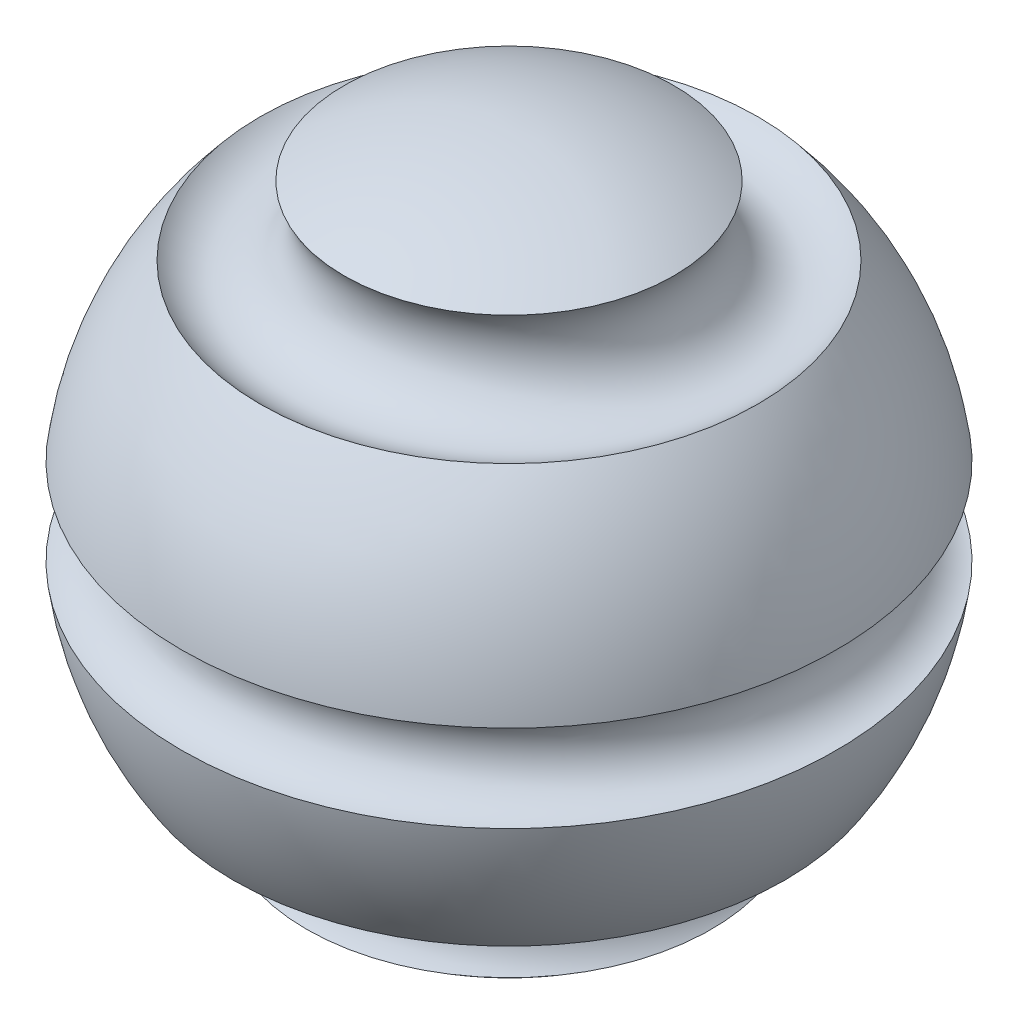
ISO-10303-21;
HEADER;
FILE_DESCRIPTION(('STEP AP214'),'2;1');
FILE_NAME('part.step','',(''),(''),'','','');
FILE_SCHEMA(('AUTOMOTIVE_DESIGN { 1 0 10303 214 1 1 1 1 }'));
ENDSEC;
DATA;
#1=APPLICATION_CONTEXT('core data for automotive mechanical design processes');
#2=APPLICATION_PROTOCOL_DEFINITION('international standard','automotive_design',2000,#1);
#3=PRODUCT_CONTEXT('',#1,'mechanical');
#4=PRODUCT('Part','Part','',(#3));
#5=PRODUCT_RELATED_PRODUCT_CATEGORY('part','',(#4));
#6=PRODUCT_DEFINITION_FORMATION('','',#4);
#7=PRODUCT_DEFINITION_CONTEXT('part definition',#1,'design');
#8=PRODUCT_DEFINITION('design','',#6,#7);
#9=PRODUCT_DEFINITION_SHAPE('','',#8);
#10=(LENGTH_UNIT() NAMED_UNIT(*) SI_UNIT(.MILLI.,.METRE.));
#11=(NAMED_UNIT(*) PLANE_ANGLE_UNIT() SI_UNIT($,.RADIAN.));
#12=(NAMED_UNIT(*) SI_UNIT($,.STERADIAN.) SOLID_ANGLE_UNIT());
#13=UNCERTAINTY_MEASURE_WITH_UNIT(LENGTH_MEASURE(1.E-05),#10,'distance_accuracy_value','');
#14=(GEOMETRIC_REPRESENTATION_CONTEXT(3) GLOBAL_UNCERTAINTY_ASSIGNED_CONTEXT((#13)) GLOBAL_UNIT_ASSIGNED_CONTEXT((#10,
#11,#12)) REPRESENTATION_CONTEXT('',''));
#15=CARTESIAN_POINT('',(0.,0.,0.));
#16=DIRECTION('',(0.,0.,1.));
#17=DIRECTION('',(1.,0.,0.));
#18=AXIS2_PLACEMENT_3D('',#15,#16,#17);
#19=CARTESIAN_POINT('',(0.,0.,0.));
#20=DIRECTION('',(0.,1.,0.));
#21=DIRECTION('',(1.,0.,0.));
#22=AXIS2_PLACEMENT_3D('',#19,#20,#21);
#23=SPHERICAL_SURFACE('',#22,10.);
#24=CARTESIAN_POINT('',(0.,8.66444703677804,0.));
#25=DIRECTION('',(0.,1.,0.));
#26=DIRECTION('',(0.,0.,1.));
#27=AXIS2_PLACEMENT_3D('',#24,#25,#26);
#28=CIRCLE('',#27,4.99273047008029);
#29=CARTESIAN_POINT('',(0.,8.66444703677804,4.99273047008029));
#30=VERTEX_POINT('',#29);
#31=EDGE_CURVE('E10',#30,#30,#28,.T.);
#32=ORIENTED_EDGE('',*,*,#31,.T.);
#33=EDGE_LOOP('',(#32));
#34=FACE_BOUND('',#33,.T.);
#35=ADVANCED_FACE('F41',(#34),#23,.T.);
#36=CARTESIAN_POINT('',(0.,7.72410729917138,0.));
#37=DIRECTION('',(0.,1.,0.));
#38=DIRECTION('',(0.,0.,1.));
#39=AXIS2_PLACEMENT_3D('',#36,#37,#38);
#40=TOROIDAL_SURFACE('',#39,6.3512334574386,1.65220131605794);
#41=CARTESIAN_POINT('',(0.,6.57291726040335,0.));
#42=DIRECTION('',(0.,1.,0.));
#43=DIRECTION('',(0.,0.,1.));
#44=AXIS2_PLACEMENT_3D('',#41,#42,#43);
#45=CIRCLE('',#44,7.53636243076802);
#46=CARTESIAN_POINT('',(0.,6.57291726040335,7.53636243076802));
#47=VERTEX_POINT('',#46);
#48=EDGE_CURVE('E47',#47,#47,#45,.T.);
#49=ORIENTED_EDGE('',*,*,#48,.T.);
#50=EDGE_LOOP('',(#49));
#51=FACE_BOUND('',#50,.T.);
#52=ORIENTED_EDGE('',*,*,#31,.F.);
#53=EDGE_LOOP('',(#52));
#54=FACE_BOUND('',#53,.T.);
#55=ADVANCED_FACE('F79',(#51,#54),#40,.F.);
#56=CARTESIAN_POINT('',(0.,0.,0.));
#57=DIRECTION('',(0.,1.,0.));
#58=DIRECTION('',(-1.,0.,0.));
#59=AXIS2_PLACEMENT_3D('',#56,#57,#58);
#60=SPHERICAL_SURFACE('',#59,10.);
#61=CARTESIAN_POINT('',(0.,1.31620190486166,0.));
#62=DIRECTION('',(0.,1.,0.));
#63=DIRECTION('',(0.,0.,1.));
#64=AXIS2_PLACEMENT_3D('',#61,#62,#63);
#65=CIRCLE('',#64,9.91300219639028);
#66=CARTESIAN_POINT('',(0.,1.31620190486166,9.91300219639028));
#67=VERTEX_POINT('',#66);
#68=EDGE_CURVE('E51',#67,#67,#65,.T.);
#69=ORIENTED_EDGE('',*,*,#68,.T.);
#70=EDGE_LOOP('',(#69));
#71=FACE_BOUND('',#70,.T.);
#72=ORIENTED_EDGE('',*,*,#48,.F.);
#73=EDGE_LOOP('',(#72));
#74=FACE_BOUND('',#73,.T.);
#75=ADVANCED_FACE('F83',(#71,#74),#60,.T.);
#76=CARTESIAN_POINT('',(0.,0.,0.));
#77=DIRECTION('',(0.,1.,0.));
#78=DIRECTION('',(0.,0.,1.));
#79=AXIS2_PLACEMENT_3D('',#76,#77,#78);
#80=TOROIDAL_SURFACE('',#79,10.,1.31907394493045);
#81=CARTESIAN_POINT('',(0.,-1.31620190486166,0.));
#82=DIRECTION('',(0.,1.,0.));
#83=DIRECTION('',(0.,0.,1.));
#84=AXIS2_PLACEMENT_3D('',#81,#82,#83);
#85=CIRCLE('',#84,9.91300219639028);
#86=CARTESIAN_POINT('',(0.,-1.31620190486166,9.91300219639028));
#87=VERTEX_POINT('',#86);
#88=EDGE_CURVE('E55',#87,#87,#85,.T.);
#89=ORIENTED_EDGE('',*,*,#88,.T.);
#90=EDGE_LOOP('',(#89));
#91=FACE_BOUND('',#90,.T.);
#92=ORIENTED_EDGE('',*,*,#68,.F.);
#93=EDGE_LOOP('',(#92));
#94=FACE_BOUND('',#93,.T.);
#95=ADVANCED_FACE('F87',(#91,#94),#80,.F.);
#96=CARTESIAN_POINT('',(0.,0.,0.));
#97=DIRECTION('',(0.,1.,0.));
#98=DIRECTION('',(-1.,0.,0.));
#99=AXIS2_PLACEMENT_3D('',#96,#97,#98);
#100=SPHERICAL_SURFACE('',#99,10.);
#101=CARTESIAN_POINT('',(0.,-5.50589646220638,0.));
#102=DIRECTION('',(0.,1.,0.));
#103=DIRECTION('',(0.,0.,1.));
#104=AXIS2_PLACEMENT_3D('',#101,#102,#103);
#105=CIRCLE('',#104,8.34776042705247);
#106=CARTESIAN_POINT('',(0.,-5.50589646220638,8.34776042705247));
#107=VERTEX_POINT('',#106);
#108=EDGE_CURVE('E60',#107,#107,#105,.T.);
#109=ORIENTED_EDGE('',*,*,#108,.T.);
#110=EDGE_LOOP('',(#109));
#111=FACE_BOUND('',#110,.T.);
#112=ORIENTED_EDGE('',*,*,#88,.F.);
#113=EDGE_LOOP('',(#112));
#114=FACE_BOUND('',#113,.T.);
#115=ADVANCED_FACE('F76',(#111,#114),#100,.T.);
#116=CARTESIAN_POINT('',(0.,-6.79546363295441,0.));
#117=DIRECTION('',(0.,1.,0.));
#118=DIRECTION('',(0.,0.,1.));
#119=AXIS2_PLACEMENT_3D('',#116,#117,#118);
#120=TOROIDAL_SURFACE('',#119,7.33632564797897,1.63889712922763);
#121=CARTESIAN_POINT('',(0.,-7.90250575137345,0.));
#122=DIRECTION('',(0.,1.,0.));
#123=DIRECTION('',(0.,0.,1.));
#124=AXIS2_PLACEMENT_3D('',#121,#122,#123);
#125=CIRCLE('',#124,6.12783835047153);
#126=CARTESIAN_POINT('',(0.,-7.90250575137345,6.12783835047153));
#127=VERTEX_POINT('',#126);
#128=EDGE_CURVE('E63',#127,#127,#125,.T.);
#129=ORIENTED_EDGE('',*,*,#128,.T.);
#130=EDGE_LOOP('',(#129));
#131=FACE_BOUND('',#130,.T.);
#132=ORIENTED_EDGE('',*,*,#108,.F.);
#133=EDGE_LOOP('',(#132));
#134=FACE_BOUND('',#133,.T.);
#135=ADVANCED_FACE('F67',(#131,#134),#120,.F.);
#136=CARTESIAN_POINT('',(0.,0.,0.));
#137=DIRECTION('',(0.,1.,0.));
#138=DIRECTION('',(-1.,0.,0.));
#139=AXIS2_PLACEMENT_3D('',#136,#137,#138);
#140=SPHERICAL_SURFACE('',#139,10.);
#141=ORIENTED_EDGE('',*,*,#128,.F.);
#142=EDGE_LOOP('',(#141));
#143=FACE_BOUND('',#142,.T.);
#144=ADVANCED_FACE('F70',(#143),#140,.T.);
#145=CLOSED_SHELL('',(#35,#55,#75,#95,#115,#135,#144));
#146=MANIFOLD_SOLID_BREP('B2',#145);
#147=ADVANCED_BREP_SHAPE_REPRESENTATION('',(#18,#146),#14);
#148=SHAPE_DEFINITION_REPRESENTATION(#9,#147);
ENDSEC;
END-ISO-10303-21;
